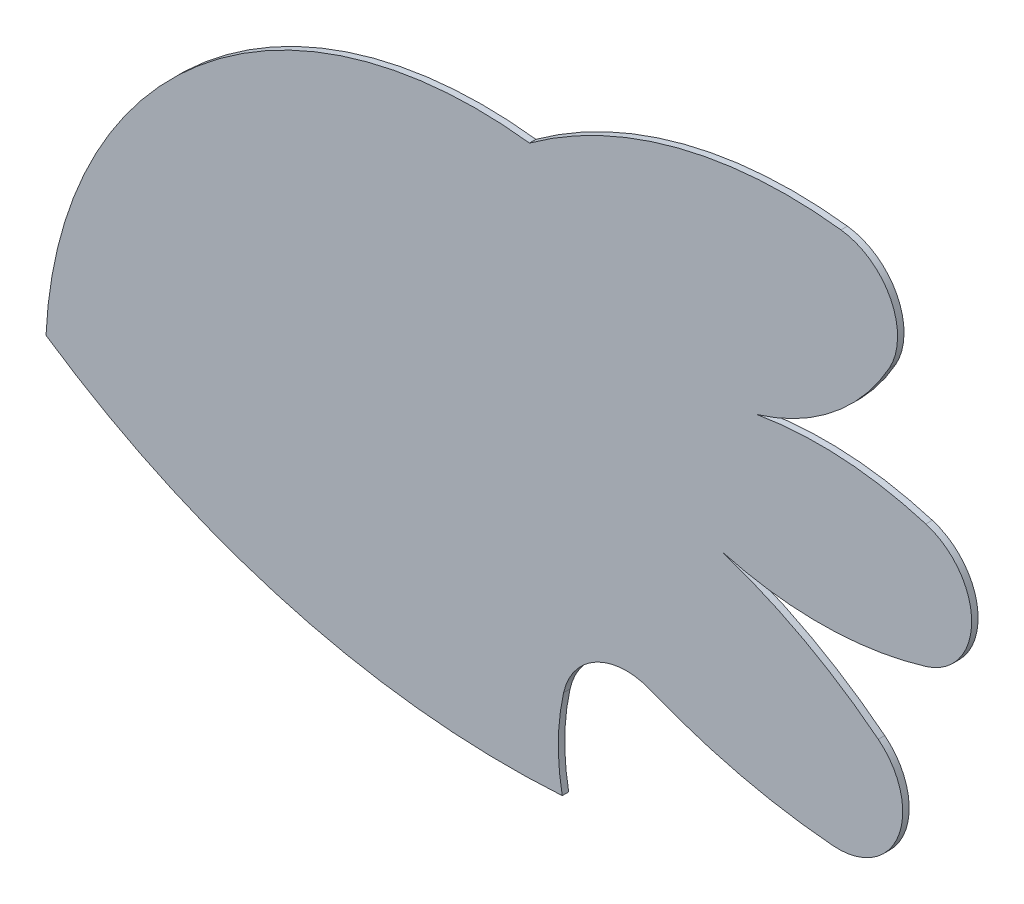
ISO-10303-21;
HEADER;
FILE_DESCRIPTION(('STEP AP214'),'2;1');
FILE_NAME('part.step','',(''),(''),'','','');
FILE_SCHEMA(('AUTOMOTIVE_DESIGN { 1 0 10303 214 1 1 1 1 }'));
ENDSEC;
DATA;
#1=APPLICATION_CONTEXT('core data for automotive mechanical design processes');
#2=APPLICATION_PROTOCOL_DEFINITION('international standard','automotive_design',2000,#1);
#3=PRODUCT_CONTEXT('',#1,'mechanical');
#4=PRODUCT('Part','Part','',(#3));
#5=PRODUCT_RELATED_PRODUCT_CATEGORY('part','',(#4));
#6=PRODUCT_DEFINITION_FORMATION('','',#4);
#7=PRODUCT_DEFINITION_CONTEXT('part definition',#1,'design');
#8=PRODUCT_DEFINITION('design','',#6,#7);
#9=PRODUCT_DEFINITION_SHAPE('','',#8);
#10=(LENGTH_UNIT() NAMED_UNIT(*) SI_UNIT(.MILLI.,.METRE.));
#11=(NAMED_UNIT(*) PLANE_ANGLE_UNIT() SI_UNIT($,.RADIAN.));
#12=(NAMED_UNIT(*) SI_UNIT($,.STERADIAN.) SOLID_ANGLE_UNIT());
#13=UNCERTAINTY_MEASURE_WITH_UNIT(LENGTH_MEASURE(1.E-05),#10,'distance_accuracy_value','');
#14=(GEOMETRIC_REPRESENTATION_CONTEXT(3) GLOBAL_UNCERTAINTY_ASSIGNED_CONTEXT((#13)) GLOBAL_UNIT_ASSIGNED_CONTEXT((#10,
#11,#12)) REPRESENTATION_CONTEXT('',''));
#15=CARTESIAN_POINT('',(0.,0.,0.));
#16=DIRECTION('',(0.,0.,1.));
#17=DIRECTION('',(1.,0.,0.));
#18=AXIS2_PLACEMENT_3D('',#15,#16,#17);
#19=CARTESIAN_POINT('',(29.2207686062599,13.5514349973327,0.1));
#20=DIRECTION('',(0.,0.,-1.));
#21=DIRECTION('',(-1.,0.,0.));
#22=AXIS2_PLACEMENT_3D('',#19,#20,#21);
#23=CYLINDRICAL_SURFACE('',#22,6.68741064980928);
#24=CARTESIAN_POINT('',(29.2207686062599,13.5514349973327,0.));
#25=DIRECTION('',(0.,0.,1.));
#26=DIRECTION('',(1.,0.,0.));
#27=AXIS2_PLACEMENT_3D('',#24,#25,#26);
#28=CIRCLE('',#27,6.68741064980928);
#29=CARTESIAN_POINT('',(30.0402489887818,20.1884458532712,0.));
#30=VERTEX_POINT('',#29);
#31=CARTESIAN_POINT('',(22.5402489887818,13.8549458532712,0.));
#32=VERTEX_POINT('',#31);
#33=EDGE_CURVE('E158',#30,#32,#28,.T.);
#34=ORIENTED_EDGE('',*,*,#33,.T.);
#35=DIRECTION('',(0.,0.,-1.));
#36=VECTOR('',#35,1.);
#37=CARTESIAN_POINT('',(22.5402489887818,13.8549458532712,0.1));
#38=LINE('',#37,#36);
#39=CARTESIAN_POINT('',(22.5402489887818,13.8549458532712,0.1));
#40=VERTEX_POINT('',#39);
#41=EDGE_CURVE('E11',#40,#32,#38,.T.);
#42=ORIENTED_EDGE('',*,*,#41,.F.);
#43=CARTESIAN_POINT('',(29.2207686062599,13.5514349973327,0.1));
#44=DIRECTION('',(0.,0.,1.));
#45=DIRECTION('',(1.,0.,0.));
#46=AXIS2_PLACEMENT_3D('',#43,#44,#45);
#47=CIRCLE('',#46,6.68741064980928);
#48=CARTESIAN_POINT('',(30.0402489887818,20.1884458532712,0.1));
#49=VERTEX_POINT('',#48);
#50=EDGE_CURVE('E182',#49,#40,#47,.T.);
#51=ORIENTED_EDGE('',*,*,#50,.F.);
#52=DIRECTION('',(0.,0.,-1.));
#53=VECTOR('',#52,1.);
#54=CARTESIAN_POINT('',(30.0402489887818,20.1884458532712,0.1));
#55=LINE('',#54,#53);
#56=EDGE_CURVE('E154',#49,#30,#55,.T.);
#57=ORIENTED_EDGE('',*,*,#56,.T.);
#58=EDGE_LOOP('',(#34,#42,#51,#57));
#59=FACE_BOUND('',#58,.T.);
#60=ADVANCED_FACE('F32',(#59),#23,.T.);
#61=CARTESIAN_POINT('',(29.7151397381193,24.4151057678701,0.1));
#62=DIRECTION('',(0.,0.,-1.));
#63=DIRECTION('',(-1.,0.,0.));
#64=AXIS2_PLACEMENT_3D('',#61,#62,#63);
#65=CYLINDRICAL_SURFACE('',#64,12.7669900402103);
#66=CARTESIAN_POINT('',(29.7151397381193,24.4151057678701,0.));
#67=DIRECTION('',(0.,0.,1.));
#68=DIRECTION('',(1.,0.,0.));
#69=AXIS2_PLACEMENT_3D('',#66,#67,#68);
#70=CIRCLE('',#69,12.7669900402103);
#71=CARTESIAN_POINT('',(30.5483592428122,11.675334186565,0.));
#72=VERTEX_POINT('',#71);
#73=EDGE_CURVE('E161',#32,#72,#70,.T.);
#74=ORIENTED_EDGE('',*,*,#73,.T.);
#75=DIRECTION('',(0.,0.,-1.));
#76=VECTOR('',#75,1.);
#77=CARTESIAN_POINT('',(30.5483592428122,11.675334186565,0.1));
#78=LINE('',#77,#76);
#79=CARTESIAN_POINT('',(30.5483592428122,11.675334186565,0.1));
#80=VERTEX_POINT('',#79);
#81=EDGE_CURVE('E40',#80,#72,#78,.T.);
#82=ORIENTED_EDGE('',*,*,#81,.F.);
#83=CARTESIAN_POINT('',(29.7151397381193,24.4151057678701,0.1));
#84=DIRECTION('',(0.,0.,1.));
#85=DIRECTION('',(1.,0.,0.));
#86=AXIS2_PLACEMENT_3D('',#83,#84,#85);
#87=CIRCLE('',#86,12.7669900402103);
#88=EDGE_CURVE('E106',#40,#80,#87,.T.);
#89=ORIENTED_EDGE('',*,*,#88,.F.);
#90=ORIENTED_EDGE('',*,*,#41,.T.);
#91=EDGE_LOOP('',(#74,#82,#89,#90));
#92=FACE_BOUND('',#91,.T.);
#93=ADVANCED_FACE('F265',(#92),#65,.T.);
#94=CARTESIAN_POINT('',(33.913693886401,12.3213338467999,0.1));
#95=DIRECTION('',(0.,0.,-1.));
#96=DIRECTION('',(-1.,0.,0.));
#97=AXIS2_PLACEMENT_3D('',#94,#95,#96);
#98=CYLINDRICAL_SURFACE('',#97,3.42677586433118);
#99=CARTESIAN_POINT('',(33.913693886401,12.3213338467999,0.));
#100=DIRECTION('',(0.,0.,-1.));
#101=DIRECTION('',(1.,0.,0.));
#102=AXIS2_PLACEMENT_3D('',#99,#100,#101);
#103=CIRCLE('',#102,3.42677586433118);
#104=CARTESIAN_POINT('',(30.5695137000916,13.0691651819675,0.));
#105=VERTEX_POINT('',#104);
#106=EDGE_CURVE('E163',#72,#105,#103,.T.);
#107=ORIENTED_EDGE('',*,*,#106,.T.);
#108=DIRECTION('',(0.,0.,-1.));
#109=VECTOR('',#108,1.);
#110=CARTESIAN_POINT('',(30.5695137000916,13.0691651819675,0.1));
#111=LINE('',#110,#109);
#112=CARTESIAN_POINT('',(30.5695137000916,13.0691651819675,0.1));
#113=VERTEX_POINT('',#112);
#114=EDGE_CURVE('E204',#113,#105,#111,.T.);
#115=ORIENTED_EDGE('',*,*,#114,.F.);
#116=CARTESIAN_POINT('',(33.913693886401,12.3213338467999,0.1));
#117=DIRECTION('',(0.,0.,-1.));
#118=DIRECTION('',(1.,0.,0.));
#119=AXIS2_PLACEMENT_3D('',#116,#117,#118);
#120=CIRCLE('',#119,3.42677586433118);
#121=EDGE_CURVE('E212',#80,#113,#120,.T.);
#122=ORIENTED_EDGE('',*,*,#121,.F.);
#123=ORIENTED_EDGE('',*,*,#81,.T.);
#124=EDGE_LOOP('',(#107,#115,#122,#123));
#125=FACE_BOUND('',#124,.T.);
#126=ADVANCED_FACE('F210',(#125),#98,.F.);
#127=CARTESIAN_POINT('',(31.5454106710953,12.8509334198755,0.1));
#128=DIRECTION('',(0.,0.,-1.));
#129=DIRECTION('',(-1.,0.,0.));
#130=AXIS2_PLACEMENT_3D('',#127,#128,#129);
#131=CYLINDRICAL_SURFACE('',#130,0.999999999999994);
#132=CARTESIAN_POINT('',(31.5454106710953,12.8509334198755,0.));
#133=DIRECTION('',(0.,0.,-1.));
#134=DIRECTION('',(1.,0.,0.));
#135=AXIS2_PLACEMENT_3D('',#132,#133,#134);
#136=CIRCLE('',#135,0.999999999999994);
#137=CARTESIAN_POINT('',(31.9216542375959,13.7774542122309,0.));
#138=VERTEX_POINT('',#137);
#139=EDGE_CURVE('E165',#105,#138,#136,.T.);
#140=ORIENTED_EDGE('',*,*,#139,.T.);
#141=DIRECTION('',(0.,0.,-1.));
#142=VECTOR('',#141,1.);
#143=CARTESIAN_POINT('',(31.9216542375959,13.7774542122309,0.1));
#144=LINE('',#143,#142);
#145=CARTESIAN_POINT('',(31.9216542375959,13.7774542122309,0.1));
#146=VERTEX_POINT('',#145);
#147=EDGE_CURVE('E201',#146,#138,#144,.T.);
#148=ORIENTED_EDGE('',*,*,#147,.F.);
#149=CARTESIAN_POINT('',(31.5454106710953,12.8509334198755,0.1));
#150=DIRECTION('',(0.,0.,-1.));
#151=DIRECTION('',(1.,0.,0.));
#152=AXIS2_PLACEMENT_3D('',#149,#150,#151);
#153=CIRCLE('',#152,0.999999999999994);
#154=EDGE_CURVE('E230',#113,#146,#153,.T.);
#155=ORIENTED_EDGE('',*,*,#154,.F.);
#156=ORIENTED_EDGE('',*,*,#114,.T.);
#157=EDGE_LOOP('',(#140,#148,#155,#156));
#158=FACE_BOUND('',#157,.T.);
#159=ADVANCED_FACE('F221',(#158),#131,.F.);
#160=CARTESIAN_POINT('',(35.5402489887818,22.6884458532711,0.1));
#161=DIRECTION('',(0.,0.,-1.));
#162=DIRECTION('',(-1.,0.,0.));
#163=AXIS2_PLACEMENT_3D('',#160,#161,#162);
#164=CYLINDRICAL_SURFACE('',#163,9.61769203083561);
#165=CARTESIAN_POINT('',(35.5402489887818,22.6884458532711,0.));
#166=DIRECTION('',(0.,0.,1.));
#167=DIRECTION('',(1.,0.,0.));
#168=AXIS2_PLACEMENT_3D('',#165,#166,#167);
#169=CIRCLE('',#168,9.61769203083561);
#170=CARTESIAN_POINT('',(34.7477202001793,13.1034629049694,0.));
#171=VERTEX_POINT('',#170);
#172=EDGE_CURVE('E167',#138,#171,#169,.T.);
#173=ORIENTED_EDGE('',*,*,#172,.T.);
#174=DIRECTION('',(0.,0.,-1.));
#175=VECTOR('',#174,1.);
#176=CARTESIAN_POINT('',(34.7477202001793,13.1034629049694,0.1));
#177=LINE('',#176,#175);
#178=CARTESIAN_POINT('',(34.7477202001793,13.1034629049694,0.1));
#179=VERTEX_POINT('',#178);
#180=EDGE_CURVE('E198',#179,#171,#177,.T.);
#181=ORIENTED_EDGE('',*,*,#180,.F.);
#182=CARTESIAN_POINT('',(35.5402489887818,22.6884458532711,0.1));
#183=DIRECTION('',(0.,0.,1.));
#184=DIRECTION('',(1.,0.,0.));
#185=AXIS2_PLACEMENT_3D('',#182,#183,#184);
#186=CIRCLE('',#185,9.61769203083561);
#187=EDGE_CURVE('E227',#146,#179,#186,.T.);
#188=ORIENTED_EDGE('',*,*,#187,.F.);
#189=ORIENTED_EDGE('',*,*,#147,.T.);
#190=EDGE_LOOP('',(#173,#181,#188,#189));
#191=FACE_BOUND('',#190,.T.);
#192=ADVANCED_FACE('F225',(#191),#164,.T.);
#193=CARTESIAN_POINT('',(34.8301234197939,14.1000619765107,0.1));
#194=DIRECTION('',(0.,0.,-1.));
#195=DIRECTION('',(-1.,0.,0.));
#196=AXIS2_PLACEMENT_3D('',#193,#194,#195);
#197=CYLINDRICAL_SURFACE('',#196,0.999999999999996);
#198=CARTESIAN_POINT('',(34.8301234197939,14.1000619765107,0.));
#199=DIRECTION('',(0.,0.,1.));
#200=DIRECTION('',(1.,0.,0.));
#201=AXIS2_PLACEMENT_3D('',#198,#199,#200);
#202=CIRCLE('',#201,0.999999999999996);
#203=CARTESIAN_POINT('',(35.4513317064005,14.8837074733084,0.));
#204=VERTEX_POINT('',#203);
#205=EDGE_CURVE('E169',#171,#204,#202,.T.);
#206=ORIENTED_EDGE('',*,*,#205,.T.);
#207=DIRECTION('',(0.,0.,-1.));
#208=VECTOR('',#207,1.);
#209=CARTESIAN_POINT('',(35.4513317064005,14.8837074733084,0.1));
#210=LINE('',#209,#208);
#211=CARTESIAN_POINT('',(35.4513317064005,14.8837074733084,0.1));
#212=VERTEX_POINT('',#211);
#213=EDGE_CURVE('E195',#212,#204,#210,.T.);
#214=ORIENTED_EDGE('',*,*,#213,.F.);
#215=CARTESIAN_POINT('',(34.8301234197939,14.1000619765107,0.1));
#216=DIRECTION('',(0.,0.,1.));
#217=DIRECTION('',(1.,0.,0.));
#218=AXIS2_PLACEMENT_3D('',#215,#216,#217);
#219=CIRCLE('',#218,0.999999999999996);
#220=EDGE_CURVE('E229',#179,#212,#219,.T.);
#221=ORIENTED_EDGE('',*,*,#220,.F.);
#222=ORIENTED_EDGE('',*,*,#180,.T.);
#223=EDGE_LOOP('',(#206,#214,#221,#222));
#224=FACE_BOUND('',#223,.T.);
#225=ADVANCED_FACE('F278',(#224),#197,.T.);
#226=CARTESIAN_POINT('',(30.5402489887818,8.68844585327118,0.1));
#227=DIRECTION('',(0.,0.,-1.));
#228=DIRECTION('',(-1.,0.,0.));
#229=AXIS2_PLACEMENT_3D('',#226,#227,#228);
#230=CYLINDRICAL_SURFACE('',#229,7.90569415042092);
#231=CARTESIAN_POINT('',(30.5402489887818,8.68844585327118,0.));
#232=DIRECTION('',(0.,0.,1.));
#233=DIRECTION('',(1.,0.,0.));
#234=AXIS2_PLACEMENT_3D('',#231,#232,#233);
#235=CIRCLE('',#234,7.90569415042092);
#236=CARTESIAN_POINT('',(33.0402489887818,16.1884458532712,0.));
#237=VERTEX_POINT('',#236);
#238=EDGE_CURVE('E171',#204,#237,#235,.T.);
#239=ORIENTED_EDGE('',*,*,#238,.T.);
#240=DIRECTION('',(0.,0.,-1.));
#241=VECTOR('',#240,1.);
#242=CARTESIAN_POINT('',(33.0402489887818,16.1884458532712,0.1));
#243=LINE('',#242,#241);
#244=CARTESIAN_POINT('',(33.0402489887818,16.1884458532712,0.1));
#245=VERTEX_POINT('',#244);
#246=EDGE_CURVE('E192',#245,#237,#243,.T.);
#247=ORIENTED_EDGE('',*,*,#246,.F.);
#248=CARTESIAN_POINT('',(30.5402489887818,8.68844585327118,0.1));
#249=DIRECTION('',(0.,0.,1.));
#250=DIRECTION('',(1.,0.,0.));
#251=AXIS2_PLACEMENT_3D('',#248,#249,#250);
#252=CIRCLE('',#251,7.90569415042092);
#253=EDGE_CURVE('E232',#212,#245,#252,.T.);
#254=ORIENTED_EDGE('',*,*,#253,.F.);
#255=ORIENTED_EDGE('',*,*,#213,.T.);
#256=EDGE_LOOP('',(#239,#247,#254,#255));
#257=FACE_BOUND('',#256,.T.);
#258=ADVANCED_FACE('F281',(#257),#230,.T.);
#259=CARTESIAN_POINT('',(34.5402489887818,21.6884458532712,0.1));
#260=DIRECTION('',(0.,0.,-1.));
#261=DIRECTION('',(-1.,0.,0.));
#262=AXIS2_PLACEMENT_3D('',#259,#260,#261);
#263=CYLINDRICAL_SURFACE('',#262,5.70087712549573);
#264=CARTESIAN_POINT('',(34.5402489887818,21.6884458532712,0.));
#265=DIRECTION('',(0.,0.,1.));
#266=DIRECTION('',(1.,0.,0.));
#267=AXIS2_PLACEMENT_3D('',#264,#265,#266);
#268=CIRCLE('',#267,5.70087712549573);
#269=CARTESIAN_POINT('',(36.1889527891296,16.231177692486,0.));
#270=VERTEX_POINT('',#269);
#271=EDGE_CURVE('E173',#237,#270,#268,.T.);
#272=ORIENTED_EDGE('',*,*,#271,.T.);
#273=DIRECTION('',(0.,0.,-1.));
#274=VECTOR('',#273,1.);
#275=CARTESIAN_POINT('',(36.1889527891296,16.231177692486,0.1));
#276=LINE('',#275,#274);
#277=CARTESIAN_POINT('',(36.1889527891296,16.231177692486,0.1));
#278=VERTEX_POINT('',#277);
#279=EDGE_CURVE('E189',#278,#270,#276,.T.);
#280=ORIENTED_EDGE('',*,*,#279,.F.);
#281=CARTESIAN_POINT('',(34.5402489887818,21.6884458532712,0.1));
#282=DIRECTION('',(0.,0.,1.));
#283=DIRECTION('',(1.,0.,0.));
#284=AXIS2_PLACEMENT_3D('',#281,#282,#283);
#285=CIRCLE('',#284,5.70087712549573);
#286=EDGE_CURVE('E238',#245,#278,#285,.T.);
#287=ORIENTED_EDGE('',*,*,#286,.F.);
#288=ORIENTED_EDGE('',*,*,#246,.T.);
#289=EDGE_LOOP('',(#272,#280,#287,#288));
#290=FACE_BOUND('',#289,.T.);
#291=ADVANCED_FACE('F285',(#290),#263,.T.);
#292=CARTESIAN_POINT('',(35.8997510112182,17.1884458532712,0.1));
#293=DIRECTION('',(0.,0.,-1.));
#294=DIRECTION('',(-1.,0.,0.));
#295=AXIS2_PLACEMENT_3D('',#292,#293,#294);
#296=CYLINDRICAL_SURFACE('',#295,1.00000000000001);
#297=CARTESIAN_POINT('',(35.8997510112182,17.1884458532712,0.));
#298=DIRECTION('',(0.,0.,1.));
#299=DIRECTION('',(1.,0.,0.));
#300=AXIS2_PLACEMENT_3D('',#297,#298,#299);
#301=CIRCLE('',#300,1.00000000000001);
#302=CARTESIAN_POINT('',(36.1889527891296,18.1457140140563,0.));
#303=VERTEX_POINT('',#302);
#304=EDGE_CURVE('E175',#270,#303,#301,.T.);
#305=ORIENTED_EDGE('',*,*,#304,.T.);
#306=DIRECTION('',(0.,0.,-1.));
#307=VECTOR('',#306,1.);
#308=CARTESIAN_POINT('',(36.1889527891296,18.1457140140563,0.1));
#309=LINE('',#308,#307);
#310=CARTESIAN_POINT('',(36.1889527891296,18.1457140140563,0.1));
#311=VERTEX_POINT('',#310);
#312=EDGE_CURVE('E186',#311,#303,#309,.T.);
#313=ORIENTED_EDGE('',*,*,#312,.F.);
#314=CARTESIAN_POINT('',(35.8997510112182,17.1884458532712,0.1));
#315=DIRECTION('',(0.,0.,1.));
#316=DIRECTION('',(1.,0.,0.));
#317=AXIS2_PLACEMENT_3D('',#314,#315,#316);
#318=CIRCLE('',#317,1.00000000000001);
#319=EDGE_CURVE('E240',#278,#311,#318,.T.);
#320=ORIENTED_EDGE('',*,*,#319,.F.);
#321=ORIENTED_EDGE('',*,*,#279,.T.);
#322=EDGE_LOOP('',(#305,#313,#320,#321));
#323=FACE_BOUND('',#322,.T.);
#324=ADVANCED_FACE('F246',(#323),#296,.T.);
#325=CARTESIAN_POINT('',(34.5402489887818,12.6884458532712,0.1));
#326=DIRECTION('',(0.,0.,-1.));
#327=DIRECTION('',(-1.,0.,0.));
#328=AXIS2_PLACEMENT_3D('',#325,#326,#327);
#329=CYLINDRICAL_SURFACE('',#328,5.70087712549569);
#330=CARTESIAN_POINT('',(34.5402489887818,12.6884458532712,0.));
#331=DIRECTION('',(0.,0.,1.));
#332=DIRECTION('',(1.,0.,0.));
#333=AXIS2_PLACEMENT_3D('',#330,#331,#332);
#334=CIRCLE('',#333,5.70087712549569);
#335=CARTESIAN_POINT('',(33.5696607534877,18.3060929120947,0.));
#336=VERTEX_POINT('',#335);
#337=EDGE_CURVE('E177',#303,#336,#334,.T.);
#338=ORIENTED_EDGE('',*,*,#337,.T.);
#339=DIRECTION('',(0.,0.,-1.));
#340=VECTOR('',#339,1.);
#341=CARTESIAN_POINT('',(33.5696607534877,18.3060929120947,0.1));
#342=LINE('',#341,#340);
#343=CARTESIAN_POINT('',(33.5696607534877,18.3060929120947,0.1));
#344=VERTEX_POINT('',#343);
#345=EDGE_CURVE('E149',#344,#336,#342,.T.);
#346=ORIENTED_EDGE('',*,*,#345,.F.);
#347=CARTESIAN_POINT('',(34.5402489887818,12.6884458532712,0.1));
#348=DIRECTION('',(0.,0.,1.));
#349=DIRECTION('',(1.,0.,0.));
#350=AXIS2_PLACEMENT_3D('',#347,#348,#349);
#351=CIRCLE('',#350,5.70087712549569);
#352=EDGE_CURVE('E140',#311,#344,#351,.T.);
#353=ORIENTED_EDGE('',*,*,#352,.F.);
#354=ORIENTED_EDGE('',*,*,#312,.T.);
#355=EDGE_LOOP('',(#338,#346,#353,#354));
#356=FACE_BOUND('',#355,.T.);
#357=ADVANCED_FACE('F250',(#356),#329,.T.);
#358=CARTESIAN_POINT('',(32.5402489887818,21.6884458532711,0.1));
#359=DIRECTION('',(0.,0.,-1.));
#360=DIRECTION('',(-1.,0.,0.));
#361=AXIS2_PLACEMENT_3D('',#358,#359,#360);
#362=CYLINDRICAL_SURFACE('',#361,3.53553390593273);
#363=CARTESIAN_POINT('',(32.5402489887818,21.6884458532711,0.));
#364=DIRECTION('',(0.,0.,1.));
#365=DIRECTION('',(1.,0.,0.));
#366=AXIS2_PLACEMENT_3D('',#363,#364,#365);
#367=CIRCLE('',#366,3.53553390593273);
#368=CARTESIAN_POINT('',(35.6218842521735,19.9553780232596,0.));
#369=VERTEX_POINT('',#368);
#370=EDGE_CURVE('E148',#336,#369,#367,.T.);
#371=ORIENTED_EDGE('',*,*,#370,.T.);
#372=DIRECTION('',(0.,0.,-1.));
#373=VECTOR('',#372,1.);
#374=CARTESIAN_POINT('',(35.6218842521735,19.9553780232596,0.1));
#375=LINE('',#374,#373);
#376=CARTESIAN_POINT('',(35.6218842521735,19.9553780232596,0.1));
#377=VERTEX_POINT('',#376);
#378=EDGE_CURVE('E145',#377,#369,#375,.T.);
#379=ORIENTED_EDGE('',*,*,#378,.F.);
#380=CARTESIAN_POINT('',(32.5402489887818,21.6884458532711,0.1));
#381=DIRECTION('',(0.,0.,1.));
#382=DIRECTION('',(1.,0.,0.));
#383=AXIS2_PLACEMENT_3D('',#380,#381,#382);
#384=CIRCLE('',#383,3.53553390593273);
#385=EDGE_CURVE('E134',#344,#377,#384,.T.);
#386=ORIENTED_EDGE('',*,*,#385,.F.);
#387=ORIENTED_EDGE('',*,*,#345,.T.);
#388=EDGE_LOOP('',(#371,#379,#386,#387));
#389=FACE_BOUND('',#388,.T.);
#390=ADVANCED_FACE('F146',(#389),#362,.T.);
#391=CARTESIAN_POINT('',(34.7502661754183,20.4455636292025,0.1));
#392=DIRECTION('',(0.,0.,-1.));
#393=DIRECTION('',(-1.,0.,0.));
#394=AXIS2_PLACEMENT_3D('',#391,#392,#393);
#395=CYLINDRICAL_SURFACE('',#394,1.00000000000001);
#396=CARTESIAN_POINT('',(34.7502661754183,20.4455636292025,0.));
#397=DIRECTION('',(0.,0.,1.));
#398=DIRECTION('',(1.,0.,0.));
#399=AXIS2_PLACEMENT_3D('',#396,#397,#398);
#400=CIRCLE('',#399,1.00000000000001);
#401=CARTESIAN_POINT('',(34.8726674151753,21.4380443275065,0.));
#402=VERTEX_POINT('',#401);
#403=EDGE_CURVE('E92',#369,#402,#400,.T.);
#404=ORIENTED_EDGE('',*,*,#403,.T.);
#405=DIRECTION('',(0.,0.,-1.));
#406=VECTOR('',#405,1.);
#407=CARTESIAN_POINT('',(34.8726674151753,21.4380443275065,0.1));
#408=LINE('',#407,#406);
#409=CARTESIAN_POINT('',(34.8726674151753,21.4380443275065,0.1));
#410=VERTEX_POINT('',#409);
#411=EDGE_CURVE('E150',#410,#402,#408,.T.);
#412=ORIENTED_EDGE('',*,*,#411,.F.);
#413=CARTESIAN_POINT('',(34.7502661754183,20.4455636292025,0.1));
#414=DIRECTION('',(0.,0.,1.));
#415=DIRECTION('',(1.,0.,0.));
#416=AXIS2_PLACEMENT_3D('',#413,#414,#415);
#417=CIRCLE('',#416,1.00000000000001);
#418=EDGE_CURVE('E138',#377,#410,#417,.T.);
#419=ORIENTED_EDGE('',*,*,#418,.F.);
#420=ORIENTED_EDGE('',*,*,#378,.T.);
#421=EDGE_LOOP('',(#404,#412,#419,#420));
#422=FACE_BOUND('',#421,.T.);
#423=ADVANCED_FACE('F152',(#422),#395,.T.);
#424=CARTESIAN_POINT('',(34.0402489887818,14.6884458532712,0.1));
#425=DIRECTION('',(0.,0.,-1.));
#426=DIRECTION('',(-1.,0.,0.));
#427=AXIS2_PLACEMENT_3D('',#424,#425,#426);
#428=CYLINDRICAL_SURFACE('',#427,6.8007352543677);
#429=CARTESIAN_POINT('',(34.0402489887818,14.6884458532712,0.));
#430=DIRECTION('',(0.,0.,1.));
#431=DIRECTION('',(1.,0.,0.));
#432=AXIS2_PLACEMENT_3D('',#429,#430,#431);
#433=CIRCLE('',#432,6.8007352543677);
#434=EDGE_CURVE('E98',#402,#30,#433,.T.);
#435=ORIENTED_EDGE('',*,*,#434,.T.);
#436=ORIENTED_EDGE('',*,*,#56,.F.);
#437=CARTESIAN_POINT('',(34.0402489887818,14.6884458532712,0.1));
#438=DIRECTION('',(0.,0.,1.));
#439=DIRECTION('',(1.,0.,0.));
#440=AXIS2_PLACEMENT_3D('',#437,#438,#439);
#441=CIRCLE('',#440,6.8007352543677);
#442=EDGE_CURVE('E48',#410,#49,#441,.T.);
#443=ORIENTED_EDGE('',*,*,#442,.F.);
#444=ORIENTED_EDGE('',*,*,#411,.T.);
#445=EDGE_LOOP('',(#435,#436,#443,#444));
#446=FACE_BOUND('',#445,.T.);
#447=ADVANCED_FACE('F254',(#446),#428,.T.);
#448=CARTESIAN_POINT('',(29.4679541721896,18.9832703826014,0.1));
#449=DIRECTION('',(0.,0.,1.));
#450=DIRECTION('',(1.,0.,0.));
#451=AXIS2_PLACEMENT_3D('',#448,#449,#450);
#452=PLANE('',#451);
#453=ORIENTED_EDGE('',*,*,#50,.T.);
#454=ORIENTED_EDGE('',*,*,#88,.T.);
#455=ORIENTED_EDGE('',*,*,#121,.T.);
#456=ORIENTED_EDGE('',*,*,#154,.T.);
#457=ORIENTED_EDGE('',*,*,#187,.T.);
#458=ORIENTED_EDGE('',*,*,#220,.T.);
#459=ORIENTED_EDGE('',*,*,#253,.T.);
#460=ORIENTED_EDGE('',*,*,#286,.T.);
#461=ORIENTED_EDGE('',*,*,#319,.T.);
#462=ORIENTED_EDGE('',*,*,#352,.T.);
#463=ORIENTED_EDGE('',*,*,#385,.T.);
#464=ORIENTED_EDGE('',*,*,#418,.T.);
#465=ORIENTED_EDGE('',*,*,#442,.T.);
#466=EDGE_LOOP('',(#453,#454,#455,#456,#457,#458,#459,#460,#461,#462,#463,#464,#465));
#467=FACE_BOUND('',#466,.T.);
#468=ADVANCED_FACE('F136',(#467),#452,.T.);
#469=CARTESIAN_POINT('',(29.4679541721896,18.9832703826014,0.));
#470=DIRECTION('',(0.,0.,1.));
#471=DIRECTION('',(1.,0.,0.));
#472=AXIS2_PLACEMENT_3D('',#469,#470,#471);
#473=PLANE('',#472);
#474=ORIENTED_EDGE('',*,*,#33,.F.);
#475=ORIENTED_EDGE('',*,*,#434,.F.);
#476=ORIENTED_EDGE('',*,*,#403,.F.);
#477=ORIENTED_EDGE('',*,*,#370,.F.);
#478=ORIENTED_EDGE('',*,*,#337,.F.);
#479=ORIENTED_EDGE('',*,*,#304,.F.);
#480=ORIENTED_EDGE('',*,*,#271,.F.);
#481=ORIENTED_EDGE('',*,*,#238,.F.);
#482=ORIENTED_EDGE('',*,*,#205,.F.);
#483=ORIENTED_EDGE('',*,*,#172,.F.);
#484=ORIENTED_EDGE('',*,*,#139,.F.);
#485=ORIENTED_EDGE('',*,*,#106,.F.);
#486=ORIENTED_EDGE('',*,*,#73,.F.);
#487=EDGE_LOOP('',(#474,#475,#476,#477,#478,#479,#480,#481,#482,#483,#484,#485,#486));
#488=FACE_BOUND('',#487,.T.);
#489=ADVANCED_FACE('F216',(#488),#473,.F.);
#490=CLOSED_SHELL('',(#60,#93,#126,#159,#192,#225,#258,#291,#324,#357,#390,#423,#447,#468,#489));
#491=MANIFOLD_SOLID_BREP('B2',#490);
#492=ADVANCED_BREP_SHAPE_REPRESENTATION('',(#18,#491),#14);
#493=SHAPE_DEFINITION_REPRESENTATION(#9,#492);
ENDSEC;
END-ISO-10303-21;
